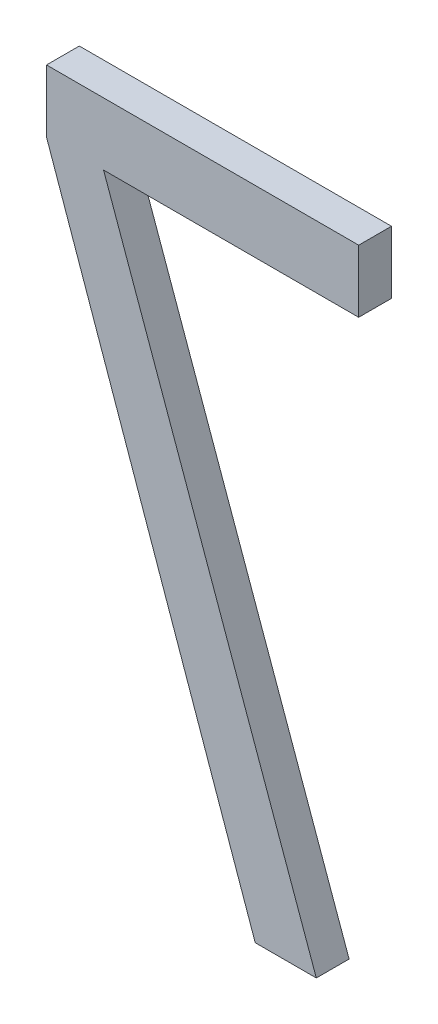
ISO-10303-21;
HEADER;
FILE_DESCRIPTION(('STEP AP214'),'2;1');
FILE_NAME('part.step','',(''),(''),'','','');
FILE_SCHEMA(('AUTOMOTIVE_DESIGN { 1 0 10303 214 1 1 1 1 }'));
ENDSEC;
DATA;
#1=APPLICATION_CONTEXT('core data for automotive mechanical design processes');
#2=APPLICATION_PROTOCOL_DEFINITION('international standard','automotive_design',2000,#1);
#3=PRODUCT_CONTEXT('',#1,'mechanical');
#4=PRODUCT('Part','Part','',(#3));
#5=PRODUCT_RELATED_PRODUCT_CATEGORY('part','',(#4));
#6=PRODUCT_DEFINITION_FORMATION('','',#4);
#7=PRODUCT_DEFINITION_CONTEXT('part definition',#1,'design');
#8=PRODUCT_DEFINITION('design','',#6,#7);
#9=PRODUCT_DEFINITION_SHAPE('','',#8);
#10=(LENGTH_UNIT() NAMED_UNIT(*) SI_UNIT(.MILLI.,.METRE.));
#11=(NAMED_UNIT(*) PLANE_ANGLE_UNIT() SI_UNIT($,.RADIAN.));
#12=(NAMED_UNIT(*) SI_UNIT($,.STERADIAN.) SOLID_ANGLE_UNIT());
#13=UNCERTAINTY_MEASURE_WITH_UNIT(LENGTH_MEASURE(1.E-05),#10,'distance_accuracy_value','');
#14=(GEOMETRIC_REPRESENTATION_CONTEXT(3) GLOBAL_UNCERTAINTY_ASSIGNED_CONTEXT((#13)) GLOBAL_UNIT_ASSIGNED_CONTEXT((#10,
#11,#12)) REPRESENTATION_CONTEXT('',''));
#15=CARTESIAN_POINT('',(0.,0.,0.));
#16=DIRECTION('',(0.,0.,1.));
#17=DIRECTION('',(1.,0.,0.));
#18=AXIS2_PLACEMENT_3D('',#15,#16,#17);
#19=CARTESIAN_POINT('',(171.28003211206,130.157011847241,-39.0997200126349));
#20=DIRECTION('',(0.,0.,-1.));
#21=DIRECTION('',(-1.,0.,0.));
#22=AXIS2_PLACEMENT_3D('',#19,#20,#21);
#23=PLANE('',#22);
#24=DIRECTION('',(-0.337556648697598,0.941305215602276,0.));
#25=VECTOR('',#24,1.);
#26=CARTESIAN_POINT('',(171.784534679972,129.252300359681,-39.0997200126349));
#27=LINE('',#26,#25);
#28=CARTESIAN_POINT('',(171.784534679972,129.252300359681,-39.0997200126349));
#29=VERTEX_POINT('',#28);
#30=CARTESIAN_POINT('',(171.135666761858,131.0617233348,-39.0997200126349));
#31=VERTEX_POINT('',#30);
#32=EDGE_CURVE('E104',#29,#31,#27,.T.);
#33=ORIENTED_EDGE('',*,*,#32,.F.);
#34=DIRECTION('',(1.,0.,0.));
#35=VECTOR('',#34,1.);
#36=CARTESIAN_POINT('',(171.598256808743,129.252300359681,-39.0997200126349));
#37=LINE('',#36,#35);
#38=CARTESIAN_POINT('',(171.598256808743,129.252300359681,-39.0997200126349));
#39=VERTEX_POINT('',#38);
#40=EDGE_CURVE('E108',#39,#29,#37,.T.);
#41=ORIENTED_EDGE('',*,*,#40,.F.);
#42=DIRECTION('',(0.33181369020547,-0.943344939559347,0.));
#43=VECTOR('',#42,1.);
#44=CARTESIAN_POINT('',(170.961807415377,131.0617233348,-39.0997200126349));
#45=LINE('',#44,#43);
#46=CARTESIAN_POINT('',(170.961807415377,131.0617233348,-39.0997200126349));
#47=VERTEX_POINT('',#46);
#48=EDGE_CURVE('E89',#47,#39,#45,.T.);
#49=ORIENTED_EDGE('',*,*,#48,.F.);
#50=DIRECTION('',(0.,1.,0.));
#51=VECTOR('',#50,1.);
#52=CARTESIAN_POINT('',(170.961807415377,131.252300359681,-39.0997200126349));
#53=LINE('',#52,#51);
#54=CARTESIAN_POINT('',(170.961807415377,131.252300359681,-39.0997200126349));
#55=VERTEX_POINT('',#54);
#56=EDGE_CURVE('E20',#55,#47,#53,.F.);
#57=ORIENTED_EDGE('',*,*,#56,.F.);
#58=DIRECTION('',(1.,0.,0.));
#59=VECTOR('',#58,1.);
#60=CARTESIAN_POINT('',(171.913764953137,131.252300359681,-39.0997200126349));
#61=LINE('',#60,#59);
#62=CARTESIAN_POINT('',(171.913764953137,131.252300359681,-39.0997200126349));
#63=VERTEX_POINT('',#62);
#64=EDGE_CURVE('E77',#63,#55,#61,.F.);
#65=ORIENTED_EDGE('',*,*,#64,.F.);
#66=DIRECTION('',(0.,1.,0.));
#67=VECTOR('',#66,1.);
#68=CARTESIAN_POINT('',(171.913764953137,131.0617233348,-39.0997200126349));
#69=LINE('',#68,#67);
#70=CARTESIAN_POINT('',(171.913764953137,131.0617233348,-39.0997200126349));
#71=VERTEX_POINT('',#70);
#72=EDGE_CURVE('E72',#71,#63,#69,.T.);
#73=ORIENTED_EDGE('',*,*,#72,.F.);
#74=DIRECTION('',(1.,0.,0.));
#75=VECTOR('',#74,1.);
#76=CARTESIAN_POINT('',(171.135666761858,131.0617233348,-39.0997200126349));
#77=LINE('',#76,#75);
#78=EDGE_CURVE('E100',#31,#71,#77,.T.);
#79=ORIENTED_EDGE('',*,*,#78,.F.);
#80=EDGE_LOOP('',(#33,#41,#49,#57,#65,#73,#79));
#81=FACE_BOUND('',#80,.T.);
#82=ADVANCED_FACE('F17',(#81),#23,.T.);
#83=CARTESIAN_POINT('',(170.961807415377,131.252300359681,-39.0997200126349));
#84=DIRECTION('',(-1.,0.,0.));
#85=DIRECTION('',(0.,0.,1.));
#86=AXIS2_PLACEMENT_3D('',#83,#84,#85);
#87=PLANE('',#86);
#88=ORIENTED_EDGE('',*,*,#56,.T.);
#89=DIRECTION('',(0.,0.,1.));
#90=VECTOR('',#89,1.);
#91=CARTESIAN_POINT('',(170.961807415377,131.0617233348,-39.0997200126349));
#92=LINE('',#91,#90);
#93=CARTESIAN_POINT('',(170.961807415377,131.0617233348,-38.9997200126349));
#94=VERTEX_POINT('',#93);
#95=EDGE_CURVE('E112',#94,#47,#92,.F.);
#96=ORIENTED_EDGE('',*,*,#95,.F.);
#97=DIRECTION('',(0.,1.,0.));
#98=VECTOR('',#97,1.);
#99=CARTESIAN_POINT('',(170.961807415377,130.157011847241,-38.9997200126349));
#100=LINE('',#99,#98);
#101=CARTESIAN_POINT('',(170.961807415377,131.252300359681,-38.9997200126349));
#102=VERTEX_POINT('',#101);
#103=EDGE_CURVE('E95',#94,#102,#100,.T.);
#104=ORIENTED_EDGE('',*,*,#103,.T.);
#105=DIRECTION('',(0.,0.,1.));
#106=VECTOR('',#105,1.);
#107=CARTESIAN_POINT('',(170.961807415377,131.252300359681,-39.0997200126349));
#108=LINE('',#107,#106);
#109=EDGE_CURVE('E82',#55,#102,#108,.T.);
#110=ORIENTED_EDGE('',*,*,#109,.F.);
#111=EDGE_LOOP('',(#88,#96,#104,#110));
#112=FACE_BOUND('',#111,.T.);
#113=ADVANCED_FACE('F94',(#112),#87,.T.);
#114=CARTESIAN_POINT('',(171.913764953137,131.252300359681,-39.0997200126349));
#115=DIRECTION('',(0.,1.,0.));
#116=DIRECTION('',(0.,0.,1.));
#117=AXIS2_PLACEMENT_3D('',#114,#115,#116);
#118=PLANE('',#117);
#119=ORIENTED_EDGE('',*,*,#64,.T.);
#120=ORIENTED_EDGE('',*,*,#109,.T.);
#121=DIRECTION('',(-1.,0.,0.));
#122=VECTOR('',#121,1.);
#123=CARTESIAN_POINT('',(171.28003211206,131.252300359681,-38.9997200126349));
#124=LINE('',#123,#122);
#125=CARTESIAN_POINT('',(171.913764953137,131.252300359681,-38.9997200126349));
#126=VERTEX_POINT('',#125);
#127=EDGE_CURVE('E117',#102,#126,#124,.F.);
#128=ORIENTED_EDGE('',*,*,#127,.T.);
#129=DIRECTION('',(0.,0.,-1.));
#130=VECTOR('',#129,1.);
#131=CARTESIAN_POINT('',(171.913764953137,131.252300359681,-39.0997200126349));
#132=LINE('',#131,#130);
#133=EDGE_CURVE('E84',#63,#126,#132,.F.);
#134=ORIENTED_EDGE('',*,*,#133,.F.);
#135=EDGE_LOOP('',(#119,#120,#128,#134));
#136=FACE_BOUND('',#135,.T.);
#137=ADVANCED_FACE('F79',(#136),#118,.T.);
#138=CARTESIAN_POINT('',(171.913764953137,131.0617233348,-39.0997200126349));
#139=DIRECTION('',(1.,0.,0.));
#140=DIRECTION('',(0.,0.,-1.));
#141=AXIS2_PLACEMENT_3D('',#138,#139,#140);
#142=PLANE('',#141);
#143=ORIENTED_EDGE('',*,*,#72,.T.);
#144=ORIENTED_EDGE('',*,*,#133,.T.);
#145=DIRECTION('',(0.,1.,0.));
#146=VECTOR('',#145,1.);
#147=CARTESIAN_POINT('',(171.913764953137,130.157011847241,-38.9997200126349));
#148=LINE('',#147,#146);
#149=CARTESIAN_POINT('',(171.913764953137,131.0617233348,-38.9997200126349));
#150=VERTEX_POINT('',#149);
#151=EDGE_CURVE('E119',#126,#150,#148,.F.);
#152=ORIENTED_EDGE('',*,*,#151,.T.);
#153=DIRECTION('',(0.,0.,-1.));
#154=VECTOR('',#153,1.);
#155=CARTESIAN_POINT('',(171.913764953137,131.0617233348,-39.0997200126349));
#156=LINE('',#155,#154);
#157=EDGE_CURVE('E102',#71,#150,#156,.F.);
#158=ORIENTED_EDGE('',*,*,#157,.F.);
#159=EDGE_LOOP('',(#143,#144,#152,#158));
#160=FACE_BOUND('',#159,.T.);
#161=ADVANCED_FACE('F144',(#160),#142,.T.);
#162=CARTESIAN_POINT('',(171.135666761858,131.0617233348,-39.0997200126349));
#163=DIRECTION('',(0.,-1.,0.));
#164=DIRECTION('',(0.,0.,-1.));
#165=AXIS2_PLACEMENT_3D('',#162,#163,#164);
#166=PLANE('',#165);
#167=ORIENTED_EDGE('',*,*,#78,.T.);
#168=ORIENTED_EDGE('',*,*,#157,.T.);
#169=DIRECTION('',(-1.,0.,0.));
#170=VECTOR('',#169,1.);
#171=CARTESIAN_POINT('',(171.28003211206,131.0617233348,-38.9997200126349));
#172=LINE('',#171,#170);
#173=CARTESIAN_POINT('',(171.135666761858,131.0617233348,-38.9997200126349));
#174=VERTEX_POINT('',#173);
#175=EDGE_CURVE('E122',#150,#174,#172,.T.);
#176=ORIENTED_EDGE('',*,*,#175,.T.);
#177=DIRECTION('',(0.,0.,1.));
#178=VECTOR('',#177,1.);
#179=CARTESIAN_POINT('',(171.135666761858,131.0617233348,-39.0997200126349));
#180=LINE('',#179,#178);
#181=EDGE_CURVE('E106',#31,#174,#180,.T.);
#182=ORIENTED_EDGE('',*,*,#181,.F.);
#183=EDGE_LOOP('',(#167,#168,#176,#182));
#184=FACE_BOUND('',#183,.T.);
#185=ADVANCED_FACE('F142',(#184),#166,.T.);
#186=CARTESIAN_POINT('',(171.784534679972,129.252300359681,-39.0997200126349));
#187=DIRECTION('',(0.941305215602276,0.337556648697598,0.));
#188=DIRECTION('',(-0.337556648697598,0.941305215602276,0.));
#189=AXIS2_PLACEMENT_3D('',#186,#187,#188);
#190=PLANE('',#189);
#191=ORIENTED_EDGE('',*,*,#32,.T.);
#192=ORIENTED_EDGE('',*,*,#181,.T.);
#193=DIRECTION('',(0.337556648697587,-0.941305215602279,0.));
#194=VECTOR('',#193,1.);
#195=CARTESIAN_POINT('',(171.135666761858,131.0617233348,-38.9997200126349));
#196=LINE('',#195,#194);
#197=CARTESIAN_POINT('',(171.784534679972,129.252300359681,-38.9997200126349));
#198=VERTEX_POINT('',#197);
#199=EDGE_CURVE('E125',#174,#198,#196,.T.);
#200=ORIENTED_EDGE('',*,*,#199,.T.);
#201=DIRECTION('',(0.,0.,-1.));
#202=VECTOR('',#201,1.);
#203=CARTESIAN_POINT('',(171.784534679972,129.252300359681,-39.0997200126349));
#204=LINE('',#203,#202);
#205=EDGE_CURVE('E110',#29,#198,#204,.F.);
#206=ORIENTED_EDGE('',*,*,#205,.F.);
#207=EDGE_LOOP('',(#191,#192,#200,#206));
#208=FACE_BOUND('',#207,.T.);
#209=ADVANCED_FACE('F138',(#208),#190,.T.);
#210=CARTESIAN_POINT('',(171.598256808743,129.252300359681,-39.0997200126349));
#211=DIRECTION('',(0.,-1.,0.));
#212=DIRECTION('',(0.,0.,-1.));
#213=AXIS2_PLACEMENT_3D('',#210,#211,#212);
#214=PLANE('',#213);
#215=ORIENTED_EDGE('',*,*,#40,.T.);
#216=ORIENTED_EDGE('',*,*,#205,.T.);
#217=DIRECTION('',(-1.,0.,0.));
#218=VECTOR('',#217,1.);
#219=CARTESIAN_POINT('',(171.28003211206,129.252300359681,-38.9997200126349));
#220=LINE('',#219,#218);
#221=CARTESIAN_POINT('',(171.598256808743,129.252300359681,-38.9997200126349));
#222=VERTEX_POINT('',#221);
#223=EDGE_CURVE('E26',#198,#222,#220,.T.);
#224=ORIENTED_EDGE('',*,*,#223,.T.);
#225=DIRECTION('',(0.,0.,1.));
#226=VECTOR('',#225,1.);
#227=CARTESIAN_POINT('',(171.598256808743,129.252300359681,-39.0997200126349));
#228=LINE('',#227,#226);
#229=EDGE_CURVE('E34',#39,#222,#228,.T.);
#230=ORIENTED_EDGE('',*,*,#229,.F.);
#231=EDGE_LOOP('',(#215,#216,#224,#230));
#232=FACE_BOUND('',#231,.T.);
#233=ADVANCED_FACE('F131',(#232),#214,.T.);
#234=CARTESIAN_POINT('',(170.961807415377,131.0617233348,-39.0997200126349));
#235=DIRECTION('',(-0.943344939559347,-0.33181369020547,0.));
#236=DIRECTION('',(0.33181369020547,-0.943344939559347,0.));
#237=AXIS2_PLACEMENT_3D('',#234,#235,#236);
#238=PLANE('',#237);
#239=ORIENTED_EDGE('',*,*,#48,.T.);
#240=ORIENTED_EDGE('',*,*,#229,.T.);
#241=DIRECTION('',(-0.33181369020544,0.943344939559358,0.));
#242=VECTOR('',#241,1.);
#243=CARTESIAN_POINT('',(171.598256808743,129.252300359681,-38.9997200126349));
#244=LINE('',#243,#242);
#245=EDGE_CURVE('E11',#222,#94,#244,.T.);
#246=ORIENTED_EDGE('',*,*,#245,.T.);
#247=ORIENTED_EDGE('',*,*,#95,.T.);
#248=EDGE_LOOP('',(#239,#240,#246,#247));
#249=FACE_BOUND('',#248,.T.);
#250=ADVANCED_FACE('F155',(#249),#238,.T.);
#251=CARTESIAN_POINT('',(171.28003211206,130.157011847241,-38.9997200126349));
#252=DIRECTION('',(0.,0.,-1.));
#253=DIRECTION('',(-1.,0.,0.));
#254=AXIS2_PLACEMENT_3D('',#251,#252,#253);
#255=PLANE('',#254);
#256=ORIENTED_EDGE('',*,*,#223,.F.);
#257=ORIENTED_EDGE('',*,*,#199,.F.);
#258=ORIENTED_EDGE('',*,*,#175,.F.);
#259=ORIENTED_EDGE('',*,*,#151,.F.);
#260=ORIENTED_EDGE('',*,*,#127,.F.);
#261=ORIENTED_EDGE('',*,*,#103,.F.);
#262=ORIENTED_EDGE('',*,*,#245,.F.);
#263=EDGE_LOOP('',(#256,#257,#258,#259,#260,#261,#262));
#264=FACE_BOUND('',#263,.T.);
#265=ADVANCED_FACE('F135',(#264),#255,.F.);
#266=CLOSED_SHELL('',(#82,#113,#137,#161,#185,#209,#233,#250,#265));
#267=MANIFOLD_SOLID_BREP('B1',#266);
#268=ADVANCED_BREP_SHAPE_REPRESENTATION('',(#18,#267),#14);
#269=SHAPE_DEFINITION_REPRESENTATION(#9,#268);
ENDSEC;
END-ISO-10303-21;
